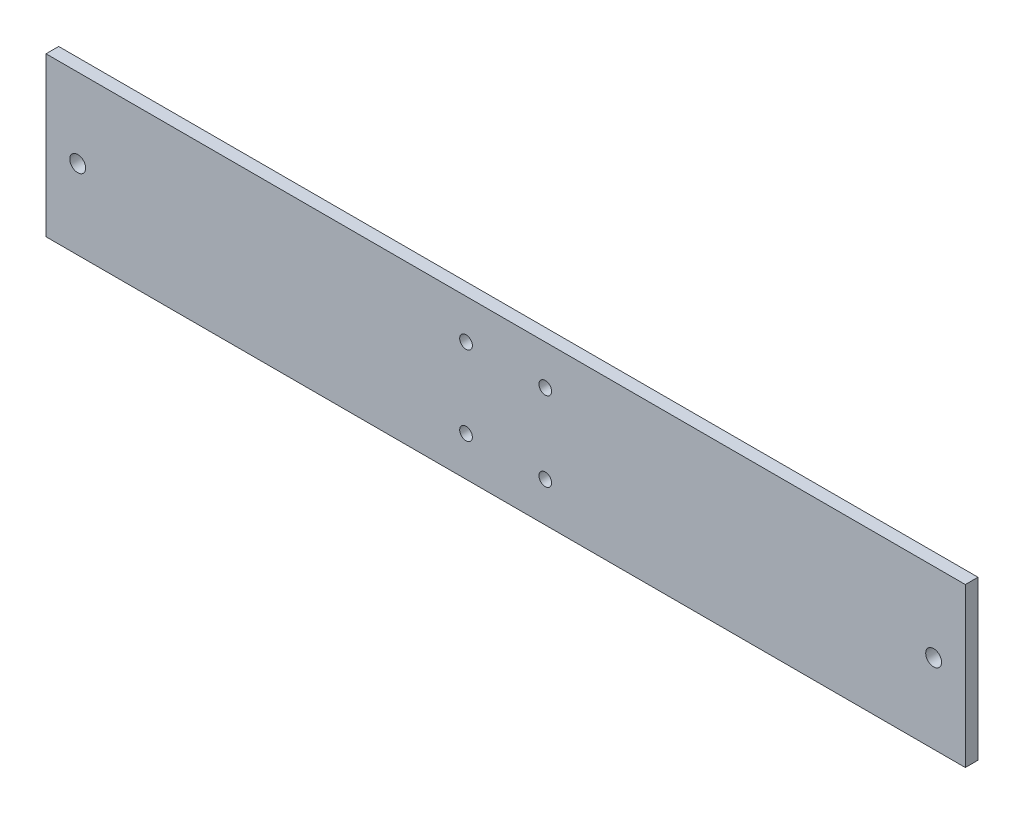
ISO-10303-21;
HEADER;
FILE_DESCRIPTION(('STEP AP214'),'2;1');
FILE_NAME('part.step','',(''),(''),'','','');
FILE_SCHEMA(('AUTOMOTIVE_DESIGN { 1 0 10303 214 1 1 1 1 }'));
ENDSEC;
DATA;
#1=APPLICATION_CONTEXT('core data for automotive mechanical design processes');
#2=APPLICATION_PROTOCOL_DEFINITION('international standard','automotive_design',2000,#1);
#3=PRODUCT_CONTEXT('',#1,'mechanical');
#4=PRODUCT('Part','Part','',(#3));
#5=PRODUCT_RELATED_PRODUCT_CATEGORY('part','',(#4));
#6=PRODUCT_DEFINITION_FORMATION('','',#4);
#7=PRODUCT_DEFINITION_CONTEXT('part definition',#1,'design');
#8=PRODUCT_DEFINITION('design','',#6,#7);
#9=PRODUCT_DEFINITION_SHAPE('','',#8);
#10=(LENGTH_UNIT() NAMED_UNIT(*) SI_UNIT(.MILLI.,.METRE.));
#11=(NAMED_UNIT(*) PLANE_ANGLE_UNIT() SI_UNIT($,.RADIAN.));
#12=(NAMED_UNIT(*) SI_UNIT($,.STERADIAN.) SOLID_ANGLE_UNIT());
#13=UNCERTAINTY_MEASURE_WITH_UNIT(LENGTH_MEASURE(1.E-05),#10,'distance_accuracy_value','');
#14=(GEOMETRIC_REPRESENTATION_CONTEXT(3) GLOBAL_UNCERTAINTY_ASSIGNED_CONTEXT((#13)) GLOBAL_UNIT_ASSIGNED_CONTEXT((#10,
#11,#12)) REPRESENTATION_CONTEXT('',''));
#15=CARTESIAN_POINT('',(0.,0.,0.));
#16=DIRECTION('',(0.,0.,1.));
#17=DIRECTION('',(1.,0.,0.));
#18=AXIS2_PLACEMENT_3D('',#15,#16,#17);
#19=CARTESIAN_POINT('',(0.,0.,4.));
#20=DIRECTION('',(0.,0.,1.));
#21=DIRECTION('',(1.,0.,0.));
#22=AXIS2_PLACEMENT_3D('',#19,#20,#21);
#23=PLANE('',#22);
#24=CARTESIAN_POINT('',(-135.,0.,4.));
#25=DIRECTION('',(0.,0.,1.));
#26=DIRECTION('',(1.,0.,0.));
#27=AXIS2_PLACEMENT_3D('',#24,#25,#26);
#28=CIRCLE('',#27,2.5);
#29=CARTESIAN_POINT('',(-132.5,0.,4.));
#30=VERTEX_POINT('',#29);
#31=EDGE_CURVE('E170',#30,#30,#28,.T.);
#32=ORIENTED_EDGE('',*,*,#31,.F.);
#33=EDGE_LOOP('',(#32));
#34=FACE_BOUND('',#33,.T.);
#35=CARTESIAN_POINT('',(135.,0.,4.));
#36=DIRECTION('',(0.,0.,1.));
#37=DIRECTION('',(1.,0.,0.));
#38=AXIS2_PLACEMENT_3D('',#35,#36,#37);
#39=CIRCLE('',#38,2.49999999999997);
#40=CARTESIAN_POINT('',(137.5,0.,4.));
#41=VERTEX_POINT('',#40);
#42=EDGE_CURVE('E162',#41,#41,#39,.T.);
#43=ORIENTED_EDGE('',*,*,#42,.F.);
#44=EDGE_LOOP('',(#43));
#45=FACE_BOUND('',#44,.T.);
#46=CARTESIAN_POINT('',(12.4999999999999,-12.5000000000001,4.));
#47=DIRECTION('',(0.,0.,1.));
#48=DIRECTION('',(1.,0.,0.));
#49=AXIS2_PLACEMENT_3D('',#46,#47,#48);
#50=CIRCLE('',#49,2.);
#51=CARTESIAN_POINT('',(14.4999999999999,-12.5000000000001,4.));
#52=VERTEX_POINT('',#51);
#53=EDGE_CURVE('E142',#52,#52,#50,.T.);
#54=ORIENTED_EDGE('',*,*,#53,.F.);
#55=EDGE_LOOP('',(#54));
#56=FACE_BOUND('',#55,.T.);
#57=CARTESIAN_POINT('',(-12.5,12.5,4.));
#58=DIRECTION('',(0.,0.,1.));
#59=DIRECTION('',(1.,0.,0.));
#60=AXIS2_PLACEMENT_3D('',#57,#58,#59);
#61=CIRCLE('',#60,2.);
#62=CARTESIAN_POINT('',(-10.5,12.5,4.));
#63=VERTEX_POINT('',#62);
#64=EDGE_CURVE('E112',#63,#63,#61,.T.);
#65=ORIENTED_EDGE('',*,*,#64,.F.);
#66=EDGE_LOOP('',(#65));
#67=FACE_BOUND('',#66,.T.);
#68=DIRECTION('',(0.,-1.,0.));
#69=VECTOR('',#68,1.);
#70=CARTESIAN_POINT('',(-145.,-25.,4.));
#71=LINE('',#70,#69);
#72=CARTESIAN_POINT('',(-145.,25.,4.));
#73=VERTEX_POINT('',#72);
#74=CARTESIAN_POINT('',(-145.,-25.,4.));
#75=VERTEX_POINT('',#74);
#76=EDGE_CURVE('E92',#73,#75,#71,.T.);
#77=ORIENTED_EDGE('',*,*,#76,.T.);
#78=DIRECTION('',(1.,0.,0.));
#79=VECTOR('',#78,1.);
#80=CARTESIAN_POINT('',(145.,-25.,4.));
#81=LINE('',#80,#79);
#82=CARTESIAN_POINT('',(145.,-25.,4.));
#83=VERTEX_POINT('',#82);
#84=EDGE_CURVE('E87',#75,#83,#81,.T.);
#85=ORIENTED_EDGE('',*,*,#84,.T.);
#86=DIRECTION('',(0.,1.,0.));
#87=VECTOR('',#86,1.);
#88=CARTESIAN_POINT('',(145.,-25.,4.));
#89=LINE('',#88,#87);
#90=CARTESIAN_POINT('',(145.,25.,4.));
#91=VERTEX_POINT('',#90);
#92=EDGE_CURVE('E90',#83,#91,#89,.T.);
#93=ORIENTED_EDGE('',*,*,#92,.T.);
#94=DIRECTION('',(-1.,0.,0.));
#95=VECTOR('',#94,1.);
#96=CARTESIAN_POINT('',(145.,25.,4.));
#97=LINE('',#96,#95);
#98=EDGE_CURVE('E57',#91,#73,#97,.T.);
#99=ORIENTED_EDGE('',*,*,#98,.T.);
#100=EDGE_LOOP('',(#77,#85,#93,#99));
#101=FACE_BOUND('',#100,.T.);
#102=CARTESIAN_POINT('',(12.5,12.5,4.));
#103=DIRECTION('',(0.,0.,1.));
#104=DIRECTION('',(1.,0.,0.));
#105=AXIS2_PLACEMENT_3D('',#102,#103,#104);
#106=CIRCLE('',#105,2.);
#107=CARTESIAN_POINT('',(14.5,12.5,4.));
#108=VERTEX_POINT('',#107);
#109=EDGE_CURVE('E134',#108,#108,#106,.T.);
#110=ORIENTED_EDGE('',*,*,#109,.F.);
#111=EDGE_LOOP('',(#110));
#112=FACE_BOUND('',#111,.T.);
#113=CARTESIAN_POINT('',(-12.5000000000001,-12.4999999999999,4.));
#114=DIRECTION('',(0.,0.,1.));
#115=DIRECTION('',(1.,0.,0.));
#116=AXIS2_PLACEMENT_3D('',#113,#114,#115);
#117=CIRCLE('',#116,2.);
#118=CARTESIAN_POINT('',(-10.5000000000001,-12.4999999999999,4.));
#119=VERTEX_POINT('',#118);
#120=EDGE_CURVE('E150',#119,#119,#117,.T.);
#121=ORIENTED_EDGE('',*,*,#120,.F.);
#122=EDGE_LOOP('',(#121));
#123=FACE_BOUND('',#122,.T.);
#124=ADVANCED_FACE('F39',(#34,#45,#56,#67,#101,#112,#123),#23,.T.);
#125=CARTESIAN_POINT('',(0.,0.,0.));
#126=DIRECTION('',(0.,0.,1.));
#127=DIRECTION('',(1.,0.,0.));
#128=AXIS2_PLACEMENT_3D('',#125,#126,#127);
#129=PLANE('',#128);
#130=CARTESIAN_POINT('',(-135.,0.,0.));
#131=DIRECTION('',(0.,0.,1.));
#132=DIRECTION('',(1.,0.,0.));
#133=AXIS2_PLACEMENT_3D('',#130,#131,#132);
#134=CIRCLE('',#133,2.5);
#135=CARTESIAN_POINT('',(-132.5,0.,0.));
#136=VERTEX_POINT('',#135);
#137=EDGE_CURVE('E158',#136,#136,#134,.T.);
#138=ORIENTED_EDGE('',*,*,#137,.T.);
#139=EDGE_LOOP('',(#138));
#140=FACE_BOUND('',#139,.T.);
#141=CARTESIAN_POINT('',(135.,0.,0.));
#142=DIRECTION('',(0.,0.,1.));
#143=DIRECTION('',(1.,0.,0.));
#144=AXIS2_PLACEMENT_3D('',#141,#142,#143);
#145=CIRCLE('',#144,2.49999999999997);
#146=CARTESIAN_POINT('',(137.5,0.,0.));
#147=VERTEX_POINT('',#146);
#148=EDGE_CURVE('E166',#147,#147,#145,.T.);
#149=ORIENTED_EDGE('',*,*,#148,.T.);
#150=EDGE_LOOP('',(#149));
#151=FACE_BOUND('',#150,.T.);
#152=DIRECTION('',(0.,-1.,0.));
#153=VECTOR('',#152,1.);
#154=CARTESIAN_POINT('',(-145.,-25.,0.));
#155=LINE('',#154,#153);
#156=CARTESIAN_POINT('',(-145.,25.,0.));
#157=VERTEX_POINT('',#156);
#158=CARTESIAN_POINT('',(-145.,-25.,0.));
#159=VERTEX_POINT('',#158);
#160=EDGE_CURVE('E108',#157,#159,#155,.T.);
#161=ORIENTED_EDGE('',*,*,#160,.F.);
#162=DIRECTION('',(-1.,0.,0.));
#163=VECTOR('',#162,1.);
#164=CARTESIAN_POINT('',(145.,25.,0.));
#165=LINE('',#164,#163);
#166=CARTESIAN_POINT('',(145.,25.,0.));
#167=VERTEX_POINT('',#166);
#168=EDGE_CURVE('E80',#167,#157,#165,.T.);
#169=ORIENTED_EDGE('',*,*,#168,.F.);
#170=DIRECTION('',(0.,1.,0.));
#171=VECTOR('',#170,1.);
#172=CARTESIAN_POINT('',(145.,-25.,0.));
#173=LINE('',#172,#171);
#174=CARTESIAN_POINT('',(145.,-25.,0.));
#175=VERTEX_POINT('',#174);
#176=EDGE_CURVE('E74',#175,#167,#173,.T.);
#177=ORIENTED_EDGE('',*,*,#176,.F.);
#178=DIRECTION('',(1.,0.,0.));
#179=VECTOR('',#178,1.);
#180=CARTESIAN_POINT('',(145.,-25.,0.));
#181=LINE('',#180,#179);
#182=EDGE_CURVE('E97',#159,#175,#181,.T.);
#183=ORIENTED_EDGE('',*,*,#182,.F.);
#184=EDGE_LOOP('',(#161,#169,#177,#183));
#185=FACE_BOUND('',#184,.T.);
#186=CARTESIAN_POINT('',(-12.5,12.5,0.));
#187=DIRECTION('',(0.,0.,1.));
#188=DIRECTION('',(1.,0.,0.));
#189=AXIS2_PLACEMENT_3D('',#186,#187,#188);
#190=CIRCLE('',#189,2.);
#191=CARTESIAN_POINT('',(-10.5,12.5,0.));
#192=VERTEX_POINT('',#191);
#193=EDGE_CURVE('E130',#192,#192,#190,.T.);
#194=ORIENTED_EDGE('',*,*,#193,.T.);
#195=EDGE_LOOP('',(#194));
#196=FACE_BOUND('',#195,.T.);
#197=CARTESIAN_POINT('',(12.5,12.5,0.));
#198=DIRECTION('',(0.,0.,1.));
#199=DIRECTION('',(1.,0.,0.));
#200=AXIS2_PLACEMENT_3D('',#197,#198,#199);
#201=CIRCLE('',#200,2.);
#202=CARTESIAN_POINT('',(14.5,12.5,0.));
#203=VERTEX_POINT('',#202);
#204=EDGE_CURVE('E138',#203,#203,#201,.T.);
#205=ORIENTED_EDGE('',*,*,#204,.T.);
#206=EDGE_LOOP('',(#205));
#207=FACE_BOUND('',#206,.T.);
#208=CARTESIAN_POINT('',(12.4999999999999,-12.5000000000001,0.));
#209=DIRECTION('',(0.,0.,1.));
#210=DIRECTION('',(1.,0.,0.));
#211=AXIS2_PLACEMENT_3D('',#208,#209,#210);
#212=CIRCLE('',#211,2.);
#213=CARTESIAN_POINT('',(14.4999999999999,-12.5000000000001,0.));
#214=VERTEX_POINT('',#213);
#215=EDGE_CURVE('E146',#214,#214,#212,.T.);
#216=ORIENTED_EDGE('',*,*,#215,.T.);
#217=EDGE_LOOP('',(#216));
#218=FACE_BOUND('',#217,.T.);
#219=CARTESIAN_POINT('',(-12.5000000000001,-12.4999999999999,0.));
#220=DIRECTION('',(0.,0.,1.));
#221=DIRECTION('',(1.,0.,0.));
#222=AXIS2_PLACEMENT_3D('',#219,#220,#221);
#223=CIRCLE('',#222,2.);
#224=CARTESIAN_POINT('',(-10.5000000000001,-12.4999999999999,0.));
#225=VERTEX_POINT('',#224);
#226=EDGE_CURVE('E154',#225,#225,#223,.T.);
#227=ORIENTED_EDGE('',*,*,#226,.T.);
#228=EDGE_LOOP('',(#227));
#229=FACE_BOUND('',#228,.T.);
#230=ADVANCED_FACE('F125',(#140,#151,#185,#196,#207,#218,#229),#129,.F.);
#231=CARTESIAN_POINT('',(-145.,-25.,4.));
#232=DIRECTION('',(1.,0.,0.));
#233=DIRECTION('',(0.,1.,0.));
#234=AXIS2_PLACEMENT_3D('',#231,#232,#233);
#235=PLANE('',#234);
#236=ORIENTED_EDGE('',*,*,#160,.T.);
#237=DIRECTION('',(0.,0.,-1.));
#238=VECTOR('',#237,1.);
#239=CARTESIAN_POINT('',(-145.,-25.,4.));
#240=LINE('',#239,#238);
#241=EDGE_CURVE('E11',#75,#159,#240,.T.);
#242=ORIENTED_EDGE('',*,*,#241,.F.);
#243=ORIENTED_EDGE('',*,*,#76,.F.);
#244=DIRECTION('',(0.,0.,-1.));
#245=VECTOR('',#244,1.);
#246=CARTESIAN_POINT('',(-145.,25.,4.));
#247=LINE('',#246,#245);
#248=EDGE_CURVE('E104',#73,#157,#247,.T.);
#249=ORIENTED_EDGE('',*,*,#248,.T.);
#250=EDGE_LOOP('',(#236,#242,#243,#249));
#251=FACE_BOUND('',#250,.T.);
#252=ADVANCED_FACE('F41',(#251),#235,.F.);
#253=CARTESIAN_POINT('',(145.,-25.,4.));
#254=DIRECTION('',(0.,1.,0.));
#255=DIRECTION('',(-1.,0.,0.));
#256=AXIS2_PLACEMENT_3D('',#253,#254,#255);
#257=PLANE('',#256);
#258=ORIENTED_EDGE('',*,*,#182,.T.);
#259=DIRECTION('',(0.,0.,-1.));
#260=VECTOR('',#259,1.);
#261=CARTESIAN_POINT('',(145.,-25.,4.));
#262=LINE('',#261,#260);
#263=EDGE_CURVE('E49',#83,#175,#262,.T.);
#264=ORIENTED_EDGE('',*,*,#263,.F.);
#265=ORIENTED_EDGE('',*,*,#84,.F.);
#266=ORIENTED_EDGE('',*,*,#241,.T.);
#267=EDGE_LOOP('',(#258,#264,#265,#266));
#268=FACE_BOUND('',#267,.T.);
#269=ADVANCED_FACE('F96',(#268),#257,.F.);
#270=CARTESIAN_POINT('',(145.,-25.,4.));
#271=DIRECTION('',(-1.,0.,0.));
#272=DIRECTION('',(0.,0.,1.));
#273=AXIS2_PLACEMENT_3D('',#270,#271,#272);
#274=PLANE('',#273);
#275=ORIENTED_EDGE('',*,*,#176,.T.);
#276=DIRECTION('',(0.,0.,-1.));
#277=VECTOR('',#276,1.);
#278=CARTESIAN_POINT('',(145.,25.,4.));
#279=LINE('',#278,#277);
#280=EDGE_CURVE('E99',#91,#167,#279,.T.);
#281=ORIENTED_EDGE('',*,*,#280,.F.);
#282=ORIENTED_EDGE('',*,*,#92,.F.);
#283=ORIENTED_EDGE('',*,*,#263,.T.);
#284=EDGE_LOOP('',(#275,#281,#282,#283));
#285=FACE_BOUND('',#284,.T.);
#286=ADVANCED_FACE('F100',(#285),#274,.F.);
#287=CARTESIAN_POINT('',(145.,25.,4.));
#288=DIRECTION('',(0.,-1.,0.));
#289=DIRECTION('',(1.,0.,0.));
#290=AXIS2_PLACEMENT_3D('',#287,#288,#289);
#291=PLANE('',#290);
#292=ORIENTED_EDGE('',*,*,#168,.T.);
#293=ORIENTED_EDGE('',*,*,#248,.F.);
#294=ORIENTED_EDGE('',*,*,#98,.F.);
#295=ORIENTED_EDGE('',*,*,#280,.T.);
#296=EDGE_LOOP('',(#292,#293,#294,#295));
#297=FACE_BOUND('',#296,.T.);
#298=ADVANCED_FACE('F122',(#297),#291,.F.);
#299=CARTESIAN_POINT('',(-12.5,12.5,4.));
#300=DIRECTION('',(0.,0.,-1.));
#301=DIRECTION('',(-1.,0.,0.));
#302=AXIS2_PLACEMENT_3D('',#299,#300,#301);
#303=CYLINDRICAL_SURFACE('',#302,2.);
#304=ORIENTED_EDGE('',*,*,#64,.T.);
#305=EDGE_LOOP('',(#304));
#306=FACE_BOUND('',#305,.T.);
#307=ORIENTED_EDGE('',*,*,#193,.F.);
#308=EDGE_LOOP('',(#307));
#309=FACE_BOUND('',#308,.T.);
#310=ADVANCED_FACE('F196',(#306,#309),#303,.F.);
#311=CARTESIAN_POINT('',(12.5,12.5,4.));
#312=DIRECTION('',(0.,0.,-1.));
#313=DIRECTION('',(-1.,0.,0.));
#314=AXIS2_PLACEMENT_3D('',#311,#312,#313);
#315=CYLINDRICAL_SURFACE('',#314,2.);
#316=ORIENTED_EDGE('',*,*,#109,.T.);
#317=EDGE_LOOP('',(#316));
#318=FACE_BOUND('',#317,.T.);
#319=ORIENTED_EDGE('',*,*,#204,.F.);
#320=EDGE_LOOP('',(#319));
#321=FACE_BOUND('',#320,.T.);
#322=ADVANCED_FACE('F199',(#318,#321),#315,.F.);
#323=CARTESIAN_POINT('',(12.4999999999999,-12.5000000000001,4.));
#324=DIRECTION('',(0.,0.,-1.));
#325=DIRECTION('',(-1.,0.,0.));
#326=AXIS2_PLACEMENT_3D('',#323,#324,#325);
#327=CYLINDRICAL_SURFACE('',#326,2.);
#328=ORIENTED_EDGE('',*,*,#53,.T.);
#329=EDGE_LOOP('',(#328));
#330=FACE_BOUND('',#329,.T.);
#331=ORIENTED_EDGE('',*,*,#215,.F.);
#332=EDGE_LOOP('',(#331));
#333=FACE_BOUND('',#332,.T.);
#334=ADVANCED_FACE('F213',(#330,#333),#327,.F.);
#335=CARTESIAN_POINT('',(-12.5000000000001,-12.4999999999999,4.));
#336=DIRECTION('',(0.,0.,-1.));
#337=DIRECTION('',(-1.,0.,0.));
#338=AXIS2_PLACEMENT_3D('',#335,#336,#337);
#339=CYLINDRICAL_SURFACE('',#338,2.);
#340=ORIENTED_EDGE('',*,*,#120,.T.);
#341=EDGE_LOOP('',(#340));
#342=FACE_BOUND('',#341,.T.);
#343=ORIENTED_EDGE('',*,*,#226,.F.);
#344=EDGE_LOOP('',(#343));
#345=FACE_BOUND('',#344,.T.);
#346=ADVANCED_FACE('F211',(#342,#345),#339,.F.);
#347=CARTESIAN_POINT('',(135.,0.,0.));
#348=DIRECTION('',(0.,0.,1.));
#349=DIRECTION('',(1.,0.,0.));
#350=AXIS2_PLACEMENT_3D('',#347,#348,#349);
#351=CYLINDRICAL_SURFACE('',#350,2.49999999999997);
#352=ORIENTED_EDGE('',*,*,#148,.F.);
#353=EDGE_LOOP('',(#352));
#354=FACE_BOUND('',#353,.T.);
#355=ORIENTED_EDGE('',*,*,#42,.T.);
#356=EDGE_LOOP('',(#355));
#357=FACE_BOUND('',#356,.T.);
#358=ADVANCED_FACE('F183',(#354,#357),#351,.F.);
#359=CARTESIAN_POINT('',(-135.,0.,0.));
#360=DIRECTION('',(0.,0.,1.));
#361=DIRECTION('',(1.,0.,0.));
#362=AXIS2_PLACEMENT_3D('',#359,#360,#361);
#363=CYLINDRICAL_SURFACE('',#362,2.5);
#364=ORIENTED_EDGE('',*,*,#137,.F.);
#365=EDGE_LOOP('',(#364));
#366=FACE_BOUND('',#365,.T.);
#367=ORIENTED_EDGE('',*,*,#31,.T.);
#368=EDGE_LOOP('',(#367));
#369=FACE_BOUND('',#368,.T.);
#370=ADVANCED_FACE('F180',(#366,#369),#363,.F.);
#371=CLOSED_SHELL('',(#124,#230,#252,#269,#286,#298,#310,#322,#334,#346,#358,#370));
#372=MANIFOLD_SOLID_BREP('B2',#371);
#373=ADVANCED_BREP_SHAPE_REPRESENTATION('',(#18,#372),#14);
#374=SHAPE_DEFINITION_REPRESENTATION(#9,#373);
ENDSEC;
END-ISO-10303-21;
